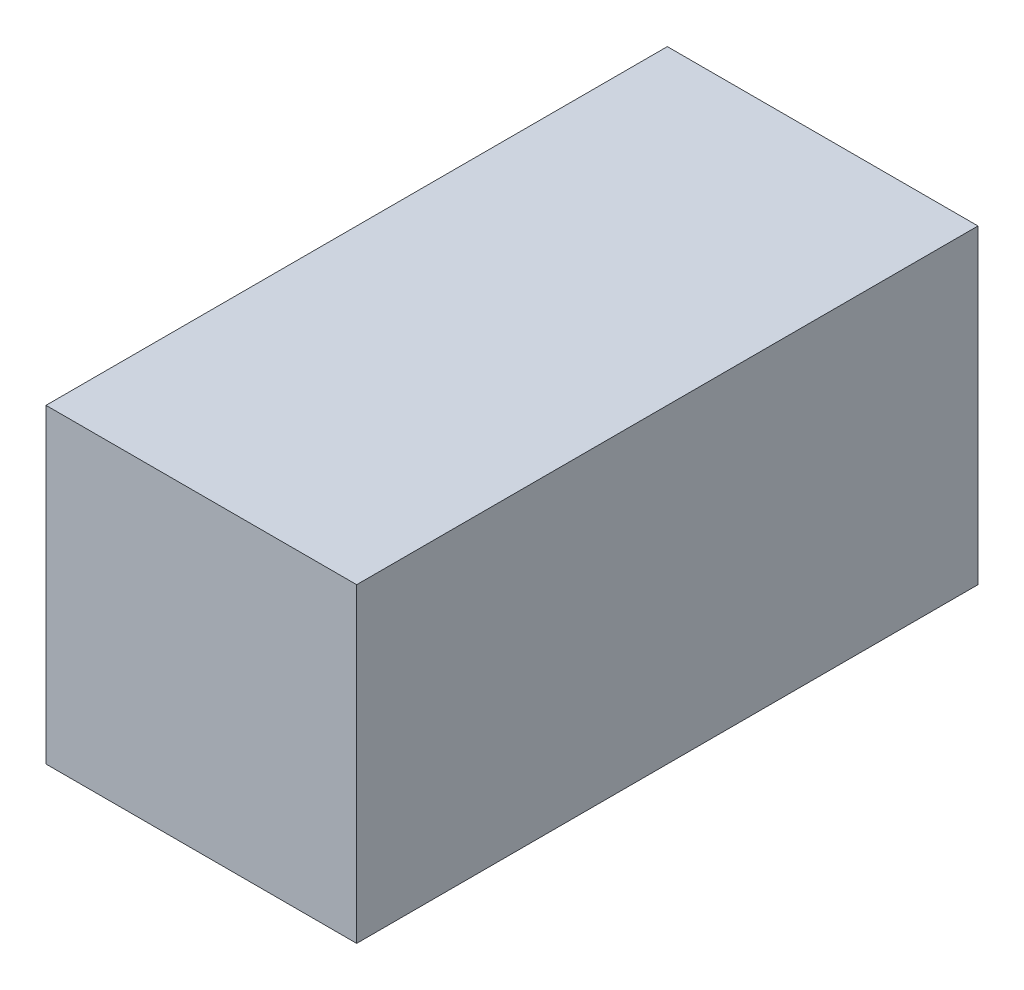
ISO-10303-21;
HEADER;
FILE_DESCRIPTION(('STEP AP214'),'2;1');
FILE_NAME('part.step','',(''),(''),'','','');
FILE_SCHEMA(('AUTOMOTIVE_DESIGN { 1 0 10303 214 1 1 1 1 }'));
ENDSEC;
DATA;
#1=APPLICATION_CONTEXT('core data for automotive mechanical design processes');
#2=APPLICATION_PROTOCOL_DEFINITION('international standard','automotive_design',2000,#1);
#3=PRODUCT_CONTEXT('',#1,'mechanical');
#4=PRODUCT('Part','Part','',(#3));
#5=PRODUCT_RELATED_PRODUCT_CATEGORY('part','',(#4));
#6=PRODUCT_DEFINITION_FORMATION('','',#4);
#7=PRODUCT_DEFINITION_CONTEXT('part definition',#1,'design');
#8=PRODUCT_DEFINITION('design','',#6,#7);
#9=PRODUCT_DEFINITION_SHAPE('','',#8);
#10=(LENGTH_UNIT() NAMED_UNIT(*) SI_UNIT(.MILLI.,.METRE.));
#11=(NAMED_UNIT(*) PLANE_ANGLE_UNIT() SI_UNIT($,.RADIAN.));
#12=(NAMED_UNIT(*) SI_UNIT($,.STERADIAN.) SOLID_ANGLE_UNIT());
#13=UNCERTAINTY_MEASURE_WITH_UNIT(LENGTH_MEASURE(1.E-05),#10,'distance_accuracy_value','');
#14=(GEOMETRIC_REPRESENTATION_CONTEXT(3) GLOBAL_UNCERTAINTY_ASSIGNED_CONTEXT((#13)) GLOBAL_UNIT_ASSIGNED_CONTEXT((#10,
#11,#12)) REPRESENTATION_CONTEXT('',''));
#15=CARTESIAN_POINT('',(0.,0.,0.));
#16=DIRECTION('',(0.,0.,1.));
#17=DIRECTION('',(1.,0.,0.));
#18=AXIS2_PLACEMENT_3D('',#15,#16,#17);
#19=CARTESIAN_POINT('',(-0.126999999999836,0.253999999999949,0.254000000000004));
#20=DIRECTION('',(1.,0.,0.));
#21=DIRECTION('',(0.,1.,0.));
#22=AXIS2_PLACEMENT_3D('',#19,#20,#21);
#23=PLANE('',#22);
#24=DIRECTION('',(0.,-1.,0.));
#25=VECTOR('',#24,1.);
#26=CARTESIAN_POINT('',(-0.126999999999836,0.253999999999949,-0.253999999999949));
#27=LINE('',#26,#25);
#28=CARTESIAN_POINT('',(-0.126999999999836,0.253999999999949,-0.253999999999949));
#29=VERTEX_POINT('',#28);
#30=CARTESIAN_POINT('',(-0.126999999999787,0.,-0.253999999999949));
#31=VERTEX_POINT('',#30);
#32=EDGE_CURVE('E95',#29,#31,#27,.T.);
#33=ORIENTED_EDGE('',*,*,#32,.T.);
#34=DIRECTION('',(0.,0.,-0.999999999999933));
#35=VECTOR('',#34,1.);
#36=CARTESIAN_POINT('',(-0.126999999999761,0.,0.254000000000004));
#37=LINE('',#36,#35);
#38=CARTESIAN_POINT('',(-0.126999999999761,0.,0.254000000000004));
#39=VERTEX_POINT('',#38);
#40=EDGE_CURVE('E11',#39,#31,#37,.T.);
#41=ORIENTED_EDGE('',*,*,#40,.F.);
#42=DIRECTION('',(0.,-1.,0.));
#43=VECTOR('',#42,1.);
#44=CARTESIAN_POINT('',(-0.126999999999836,0.253999999999949,0.254000000000004));
#45=LINE('',#44,#43);
#46=CARTESIAN_POINT('',(-0.126999999999836,0.253999999999949,0.254000000000004));
#47=VERTEX_POINT('',#46);
#48=EDGE_CURVE('E83',#47,#39,#45,.T.);
#49=ORIENTED_EDGE('',*,*,#48,.F.);
#50=DIRECTION('',(0.,0.,-0.999999999999933));
#51=VECTOR('',#50,1.);
#52=CARTESIAN_POINT('',(-0.126999999999836,0.253999999999949,0.254000000000004));
#53=LINE('',#52,#51);
#54=EDGE_CURVE('E91',#47,#29,#53,.T.);
#55=ORIENTED_EDGE('',*,*,#54,.T.);
#56=EDGE_LOOP('',(#33,#41,#49,#55));
#57=FACE_BOUND('',#56,.T.);
#58=ADVANCED_FACE('F32',(#57),#23,.F.);
#59=CARTESIAN_POINT('',(-0.126999999999761,0.,0.254000000000004));
#60=DIRECTION('',(0.,1.00000000000001,0.));
#61=DIRECTION('',(0.,0.,0.999999999999933));
#62=AXIS2_PLACEMENT_3D('',#59,#60,#61);
#63=PLANE('',#62);
#64=DIRECTION('',(1.00000000000001,0.,0.));
#65=VECTOR('',#64,1.);
#66=CARTESIAN_POINT('',(-0.126999999999787,0.,-0.253999999999949));
#67=LINE('',#66,#65);
#68=CARTESIAN_POINT('',(0.127000000000151,0.,-0.253999999999865));
#69=VERTEX_POINT('',#68);
#70=EDGE_CURVE('E87',#31,#69,#67,.T.);
#71=ORIENTED_EDGE('',*,*,#70,.T.);
#72=DIRECTION('',(0.,0.,-0.999999999999933));
#73=VECTOR('',#72,1.);
#74=CARTESIAN_POINT('',(0.12700000000008,0.,0.254000000000004));
#75=LINE('',#74,#73);
#76=CARTESIAN_POINT('',(0.12700000000008,0.,0.254000000000004));
#77=VERTEX_POINT('',#76);
#78=EDGE_CURVE('E40',#77,#69,#75,.T.);
#79=ORIENTED_EDGE('',*,*,#78,.F.);
#80=DIRECTION('',(1.00000000000001,0.,0.));
#81=VECTOR('',#80,1.);
#82=CARTESIAN_POINT('',(-0.126999999999761,0.,0.254000000000004));
#83=LINE('',#82,#81);
#84=EDGE_CURVE('E78',#39,#77,#83,.T.);
#85=ORIENTED_EDGE('',*,*,#84,.F.);
#86=ORIENTED_EDGE('',*,*,#40,.T.);
#87=EDGE_LOOP('',(#71,#79,#85,#86));
#88=FACE_BOUND('',#87,.T.);
#89=ADVANCED_FACE('F86',(#88),#63,.F.);
#90=CARTESIAN_POINT('',(0.127000000000061,0.253999999999935,0.254000000000004));
#91=DIRECTION('',(-1.00000000000001,0.,0.));
#92=DIRECTION('',(0.,-1.00000000000001,0.));
#93=AXIS2_PLACEMENT_3D('',#90,#91,#92);
#94=PLANE('',#93);
#95=DIRECTION('',(0.,1.00000000000001,0.));
#96=VECTOR('',#95,1.);
#97=CARTESIAN_POINT('',(0.127000000000214,0.253999999999976,-0.253999999999865));
#98=LINE('',#97,#96);
#99=CARTESIAN_POINT('',(0.127000000000214,0.253999999999976,-0.253999999999865));
#100=VERTEX_POINT('',#99);
#101=EDGE_CURVE('E65',#69,#100,#98,.T.);
#102=ORIENTED_EDGE('',*,*,#101,.T.);
#103=DIRECTION('',(0.,0.,-0.999999999999933));
#104=VECTOR('',#103,1.);
#105=CARTESIAN_POINT('',(0.127000000000061,0.253999999999935,0.254000000000004));
#106=LINE('',#105,#104);
#107=CARTESIAN_POINT('',(0.127000000000061,0.253999999999935,0.254000000000004));
#108=VERTEX_POINT('',#107);
#109=EDGE_CURVE('E88',#108,#100,#106,.T.);
#110=ORIENTED_EDGE('',*,*,#109,.F.);
#111=DIRECTION('',(0.,1.00000000000001,0.));
#112=VECTOR('',#111,1.);
#113=CARTESIAN_POINT('',(0.127000000000061,0.253999999999935,0.254000000000004));
#114=LINE('',#113,#112);
#115=EDGE_CURVE('E81',#77,#108,#114,.T.);
#116=ORIENTED_EDGE('',*,*,#115,.F.);
#117=ORIENTED_EDGE('',*,*,#78,.T.);
#118=EDGE_LOOP('',(#102,#110,#116,#117));
#119=FACE_BOUND('',#118,.T.);
#120=ADVANCED_FACE('F89',(#119),#94,.F.);
#121=CARTESIAN_POINT('',(-0.126999999999836,0.253999999999949,0.254000000000004));
#122=DIRECTION('',(0.,-1.00000000000001,0.));
#123=DIRECTION('',(0.,0.,-0.999999999999933));
#124=AXIS2_PLACEMENT_3D('',#121,#122,#123);
#125=PLANE('',#124);
#126=DIRECTION('',(-1.00000000000001,0.,0.));
#127=VECTOR('',#126,1.);
#128=CARTESIAN_POINT('',(-0.126999999999836,0.253999999999949,-0.253999999999949));
#129=LINE('',#128,#127);
#130=EDGE_CURVE('E71',#100,#29,#129,.T.);
#131=ORIENTED_EDGE('',*,*,#130,.T.);
#132=ORIENTED_EDGE('',*,*,#54,.F.);
#133=DIRECTION('',(-1.00000000000001,0.,0.));
#134=VECTOR('',#133,1.);
#135=CARTESIAN_POINT('',(-0.126999999999836,0.253999999999949,0.254000000000004));
#136=LINE('',#135,#134);
#137=EDGE_CURVE('E48',#108,#47,#136,.T.);
#138=ORIENTED_EDGE('',*,*,#137,.F.);
#139=ORIENTED_EDGE('',*,*,#109,.T.);
#140=EDGE_LOOP('',(#131,#132,#138,#139));
#141=FACE_BOUND('',#140,.T.);
#142=ADVANCED_FACE('F102',(#141),#125,.F.);
#143=CARTESIAN_POINT('',(-0.126999999999761,0.,0.254000000000004));
#144=DIRECTION('',(0.,0.,0.999999999999933));
#145=DIRECTION('',(1.00000000000001,0.,0.));
#146=AXIS2_PLACEMENT_3D('',#143,#144,#145);
#147=PLANE('',#146);
#148=ORIENTED_EDGE('',*,*,#48,.T.);
#149=ORIENTED_EDGE('',*,*,#84,.T.);
#150=ORIENTED_EDGE('',*,*,#115,.T.);
#151=ORIENTED_EDGE('',*,*,#137,.T.);
#152=EDGE_LOOP('',(#148,#149,#150,#151));
#153=FACE_BOUND('',#152,.T.);
#154=ADVANCED_FACE('F79',(#153),#147,.T.);
#155=CARTESIAN_POINT('',(-0.126999999999787,0.,-0.253999999999949));
#156=DIRECTION('',(0.,0.,0.999999999999933));
#157=DIRECTION('',(1.00000000000001,0.,0.));
#158=AXIS2_PLACEMENT_3D('',#155,#156,#157);
#159=PLANE('',#158);
#160=ORIENTED_EDGE('',*,*,#32,.F.);
#161=ORIENTED_EDGE('',*,*,#130,.F.);
#162=ORIENTED_EDGE('',*,*,#101,.F.);
#163=ORIENTED_EDGE('',*,*,#70,.F.);
#164=EDGE_LOOP('',(#160,#161,#162,#163));
#165=FACE_BOUND('',#164,.T.);
#166=ADVANCED_FACE('F105',(#165),#159,.F.);
#167=CLOSED_SHELL('',(#58,#89,#120,#142,#154,#166));
#168=MANIFOLD_SOLID_BREP('B2',#167);
#169=ADVANCED_BREP_SHAPE_REPRESENTATION('',(#18,#168),#14);
#170=SHAPE_DEFINITION_REPRESENTATION(#9,#169);
ENDSEC;
END-ISO-10303-21;
